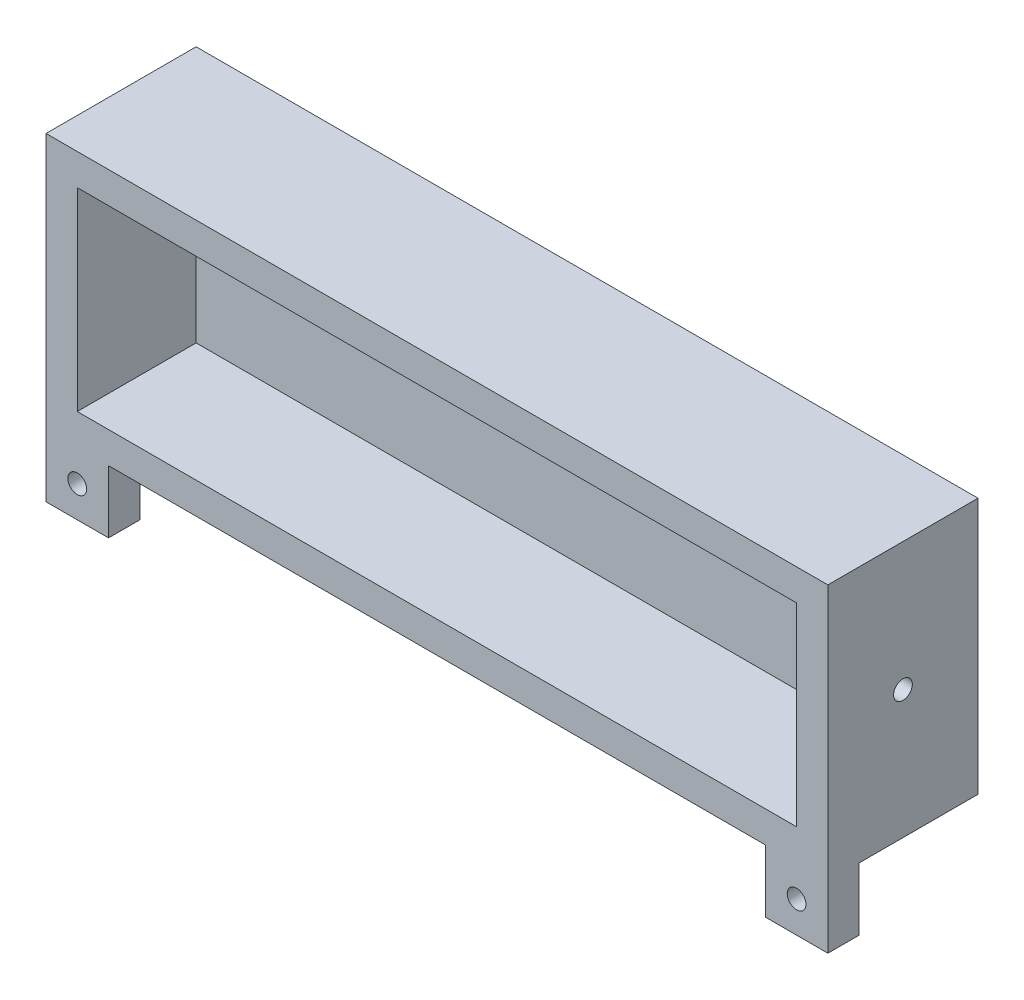
ISO-10303-21;
HEADER;
FILE_DESCRIPTION(('STEP AP214'),'2;1');
FILE_NAME('part.step','',(''),(''),'','','');
FILE_SCHEMA(('AUTOMOTIVE_DESIGN { 1 0 10303 214 1 1 1 1 }'));
ENDSEC;
DATA;
#1=APPLICATION_CONTEXT('core data for automotive mechanical design processes');
#2=APPLICATION_PROTOCOL_DEFINITION('international standard','automotive_design',2000,#1);
#3=PRODUCT_CONTEXT('',#1,'mechanical');
#4=PRODUCT('Part','Part','',(#3));
#5=PRODUCT_RELATED_PRODUCT_CATEGORY('part','',(#4));
#6=PRODUCT_DEFINITION_FORMATION('','',#4);
#7=PRODUCT_DEFINITION_CONTEXT('part definition',#1,'design');
#8=PRODUCT_DEFINITION('design','',#6,#7);
#9=PRODUCT_DEFINITION_SHAPE('','',#8);
#10=(LENGTH_UNIT() NAMED_UNIT(*) SI_UNIT(.MILLI.,.METRE.));
#11=(NAMED_UNIT(*) PLANE_ANGLE_UNIT() SI_UNIT($,.RADIAN.));
#12=(NAMED_UNIT(*) SI_UNIT($,.STERADIAN.) SOLID_ANGLE_UNIT());
#13=UNCERTAINTY_MEASURE_WITH_UNIT(LENGTH_MEASURE(1.E-05),#10,'distance_accuracy_value','');
#14=(GEOMETRIC_REPRESENTATION_CONTEXT(3) GLOBAL_UNCERTAINTY_ASSIGNED_CONTEXT((#13)) GLOBAL_UNIT_ASSIGNED_CONTEXT((#10,
#11,#12)) REPRESENTATION_CONTEXT('',''));
#15=CARTESIAN_POINT('',(0.,0.,0.));
#16=DIRECTION('',(0.,0.,1.));
#17=DIRECTION('',(1.,0.,0.));
#18=AXIS2_PLACEMENT_3D('',#15,#16,#17);
#19=CARTESIAN_POINT('',(0.,-5.,19.));
#20=DIRECTION('',(0.,1.,0.));
#21=DIRECTION('',(0.,0.,1.));
#22=AXIS2_PLACEMENT_3D('',#19,#20,#21);
#23=PLANE('',#22);
#24=DIRECTION('',(0.,0.,-1.));
#25=VECTOR('',#24,1.);
#26=CARTESIAN_POINT('',(110.,-5.,19.));
#27=LINE('',#26,#25);
#28=CARTESIAN_POINT('',(110.,-5.,19.));
#29=VERTEX_POINT('',#28);
#30=CARTESIAN_POINT('',(110.,-5.,14.));
#31=VERTEX_POINT('',#30);
#32=EDGE_CURVE('E160',#29,#31,#27,.T.);
#33=ORIENTED_EDGE('',*,*,#32,.F.);
#34=DIRECTION('',(1.,0.,0.));
#35=VECTOR('',#34,1.);
#36=CARTESIAN_POINT('',(0.,-5.,19.));
#37=LINE('',#36,#35);
#38=CARTESIAN_POINT('',(5.,-5.,19.));
#39=VERTEX_POINT('',#38);
#40=EDGE_CURVE('E143',#39,#29,#37,.T.);
#41=ORIENTED_EDGE('',*,*,#40,.F.);
#42=DIRECTION('',(0.,0.,1.));
#43=VECTOR('',#42,1.);
#44=CARTESIAN_POINT('',(5.,-5.,19.));
#45=LINE('',#44,#43);
#46=CARTESIAN_POINT('',(5.,-5.,14.));
#47=VERTEX_POINT('',#46);
#48=EDGE_CURVE('E179',#47,#39,#45,.T.);
#49=ORIENTED_EDGE('',*,*,#48,.F.);
#50=DIRECTION('',(1.,0.,0.));
#51=VECTOR('',#50,1.);
#52=CARTESIAN_POINT('',(-5.,-5.,14.));
#53=LINE('',#52,#51);
#54=CARTESIAN_POINT('',(-5.,-5.,14.));
#55=VERTEX_POINT('',#54);
#56=EDGE_CURVE('E56',#55,#47,#53,.T.);
#57=ORIENTED_EDGE('',*,*,#56,.F.);
#58=DIRECTION('',(0.,0.,-1.));
#59=VECTOR('',#58,1.);
#60=CARTESIAN_POINT('',(-5.,-5.,19.));
#61=LINE('',#60,#59);
#62=CARTESIAN_POINT('',(-5.,-5.,-5.));
#63=VERTEX_POINT('',#62);
#64=EDGE_CURVE('E11',#55,#63,#61,.T.);
#65=ORIENTED_EDGE('',*,*,#64,.T.);
#66=DIRECTION('',(1.,0.,0.));
#67=VECTOR('',#66,1.);
#68=CARTESIAN_POINT('',(0.,-5.,-5.));
#69=LINE('',#68,#67);
#70=CARTESIAN_POINT('',(120.,-5.,-5.));
#71=VERTEX_POINT('',#70);
#72=EDGE_CURVE('E233',#63,#71,#69,.T.);
#73=ORIENTED_EDGE('',*,*,#72,.T.);
#74=DIRECTION('',(0.,0.,-1.));
#75=VECTOR('',#74,1.);
#76=CARTESIAN_POINT('',(120.,-5.,19.));
#77=LINE('',#76,#75);
#78=CARTESIAN_POINT('',(120.,-5.,14.));
#79=VERTEX_POINT('',#78);
#80=EDGE_CURVE('E41',#79,#71,#77,.T.);
#81=ORIENTED_EDGE('',*,*,#80,.F.);
#82=DIRECTION('',(1.,0.,0.));
#83=VECTOR('',#82,1.);
#84=CARTESIAN_POINT('',(120.,-5.,14.));
#85=LINE('',#84,#83);
#86=EDGE_CURVE('E158',#31,#79,#85,.T.);
#87=ORIENTED_EDGE('',*,*,#86,.F.);
#88=EDGE_LOOP('',(#33,#41,#49,#57,#65,#73,#81,#87));
#89=FACE_BOUND('',#88,.T.);
#90=ADVANCED_FACE('F32',(#89),#23,.F.);
#91=CARTESIAN_POINT('',(0.,0.,19.));
#92=DIRECTION('',(0.,0.,-1.));
#93=DIRECTION('',(-1.,0.,0.));
#94=AXIS2_PLACEMENT_3D('',#91,#92,#93);
#95=PLANE('',#94);
#96=CARTESIAN_POINT('',(0.,-10.,19.));
#97=DIRECTION('',(0.,0.,-1.));
#98=DIRECTION('',(-1.,0.,0.));
#99=AXIS2_PLACEMENT_3D('',#96,#97,#98);
#100=CIRCLE('',#99,1.5);
#101=CARTESIAN_POINT('',(-1.5,-10.,19.));
#102=VERTEX_POINT('',#101);
#103=EDGE_CURVE('E168',#102,#102,#100,.T.);
#104=ORIENTED_EDGE('',*,*,#103,.T.);
#105=EDGE_LOOP('',(#104));
#106=FACE_BOUND('',#105,.T.);
#107=CARTESIAN_POINT('',(115.,-10.,19.));
#108=DIRECTION('',(0.,0.,-1.));
#109=DIRECTION('',(-1.,0.,0.));
#110=AXIS2_PLACEMENT_3D('',#107,#108,#109);
#111=CIRCLE('',#110,1.5);
#112=CARTESIAN_POINT('',(113.5,-10.,19.));
#113=VERTEX_POINT('',#112);
#114=EDGE_CURVE('E340',#113,#113,#111,.T.);
#115=ORIENTED_EDGE('',*,*,#114,.T.);
#116=EDGE_LOOP('',(#115));
#117=FACE_BOUND('',#116,.T.);
#118=DIRECTION('',(0.,-1.,0.));
#119=VECTOR('',#118,1.);
#120=CARTESIAN_POINT('',(-5.,0.,19.));
#121=LINE('',#120,#119);
#122=CARTESIAN_POINT('',(-5.,36.,19.));
#123=VERTEX_POINT('',#122);
#124=CARTESIAN_POINT('',(-5.,-15.,19.));
#125=VERTEX_POINT('',#124);
#126=EDGE_CURVE('E246',#123,#125,#121,.T.);
#127=ORIENTED_EDGE('',*,*,#126,.T.);
#128=DIRECTION('',(-1.,0.,0.));
#129=VECTOR('',#128,1.);
#130=CARTESIAN_POINT('',(-5.,-15.,19.));
#131=LINE('',#130,#129);
#132=CARTESIAN_POINT('',(5.,-15.,19.));
#133=VERTEX_POINT('',#132);
#134=EDGE_CURVE('E183',#133,#125,#131,.T.);
#135=ORIENTED_EDGE('',*,*,#134,.F.);
#136=DIRECTION('',(0.,1.,0.));
#137=VECTOR('',#136,1.);
#138=CARTESIAN_POINT('',(5.,-15.,19.));
#139=LINE('',#138,#137);
#140=EDGE_CURVE('E186',#133,#39,#139,.T.);
#141=ORIENTED_EDGE('',*,*,#140,.T.);
#142=ORIENTED_EDGE('',*,*,#40,.T.);
#143=DIRECTION('',(0.,1.,0.));
#144=VECTOR('',#143,1.);
#145=CARTESIAN_POINT('',(110.,-15.,19.));
#146=LINE('',#145,#144);
#147=CARTESIAN_POINT('',(110.,-15.,19.));
#148=VERTEX_POINT('',#147);
#149=EDGE_CURVE('E150',#148,#29,#146,.T.);
#150=ORIENTED_EDGE('',*,*,#149,.F.);
#151=DIRECTION('',(-1.,0.,0.));
#152=VECTOR('',#151,1.);
#153=CARTESIAN_POINT('',(120.,-15.,19.));
#154=LINE('',#153,#152);
#155=CARTESIAN_POINT('',(120.,-15.,19.));
#156=VERTEX_POINT('',#155);
#157=EDGE_CURVE('E146',#156,#148,#154,.T.);
#158=ORIENTED_EDGE('',*,*,#157,.F.);
#159=DIRECTION('',(0.,1.,0.));
#160=VECTOR('',#159,1.);
#161=CARTESIAN_POINT('',(120.,0.,19.));
#162=LINE('',#161,#160);
#163=CARTESIAN_POINT('',(120.,36.,19.));
#164=VERTEX_POINT('',#163);
#165=EDGE_CURVE('E133',#156,#164,#162,.T.);
#166=ORIENTED_EDGE('',*,*,#165,.T.);
#167=DIRECTION('',(-1.,0.,0.));
#168=VECTOR('',#167,1.);
#169=CARTESIAN_POINT('',(0.,36.,19.));
#170=LINE('',#169,#168);
#171=EDGE_CURVE('E142',#164,#123,#170,.T.);
#172=ORIENTED_EDGE('',*,*,#171,.T.);
#173=EDGE_LOOP('',(#127,#135,#141,#142,#150,#158,#166,#172));
#174=FACE_BOUND('',#173,.T.);
#175=DIRECTION('',(0.,-1.,0.));
#176=VECTOR('',#175,1.);
#177=CARTESIAN_POINT('',(0.,0.,19.));
#178=LINE('',#177,#176);
#179=CARTESIAN_POINT('',(0.,31.,19.));
#180=VERTEX_POINT('',#179);
#181=CARTESIAN_POINT('',(0.,0.,19.));
#182=VERTEX_POINT('',#181);
#183=EDGE_CURVE('E201',#180,#182,#178,.T.);
#184=ORIENTED_EDGE('',*,*,#183,.F.);
#185=DIRECTION('',(-1.,0.,0.));
#186=VECTOR('',#185,1.);
#187=CARTESIAN_POINT('',(0.,31.,19.));
#188=LINE('',#187,#186);
#189=CARTESIAN_POINT('',(115.,31.,19.));
#190=VERTEX_POINT('',#189);
#191=EDGE_CURVE('E209',#190,#180,#188,.T.);
#192=ORIENTED_EDGE('',*,*,#191,.F.);
#193=DIRECTION('',(0.,1.,0.));
#194=VECTOR('',#193,1.);
#195=CARTESIAN_POINT('',(115.,0.,19.));
#196=LINE('',#195,#194);
#197=CARTESIAN_POINT('',(115.,0.,19.));
#198=VERTEX_POINT('',#197);
#199=EDGE_CURVE('E206',#198,#190,#196,.T.);
#200=ORIENTED_EDGE('',*,*,#199,.F.);
#201=DIRECTION('',(1.,0.,0.));
#202=VECTOR('',#201,1.);
#203=CARTESIAN_POINT('',(0.,0.,19.));
#204=LINE('',#203,#202);
#205=EDGE_CURVE('E203',#182,#198,#204,.T.);
#206=ORIENTED_EDGE('',*,*,#205,.F.);
#207=EDGE_LOOP('',(#184,#192,#200,#206));
#208=FACE_BOUND('',#207,.T.);
#209=ADVANCED_FACE('F147',(#106,#117,#174,#208),#95,.F.);
#210=CARTESIAN_POINT('',(-5.,0.,19.));
#211=DIRECTION('',(1.,0.,0.));
#212=DIRECTION('',(0.,0.,-1.));
#213=AXIS2_PLACEMENT_3D('',#210,#211,#212);
#214=PLANE('',#213);
#215=DIRECTION('',(0.,-1.,0.));
#216=VECTOR('',#215,1.);
#217=CARTESIAN_POINT('',(-5.,0.,-5.));
#218=LINE('',#217,#216);
#219=CARTESIAN_POINT('',(-5.,36.,-5.));
#220=VERTEX_POINT('',#219);
#221=EDGE_CURVE('E231',#220,#63,#218,.T.);
#222=ORIENTED_EDGE('',*,*,#221,.T.);
#223=ORIENTED_EDGE('',*,*,#64,.F.);
#224=DIRECTION('',(0.,1.,0.));
#225=VECTOR('',#224,1.);
#226=CARTESIAN_POINT('',(-5.,-15.,14.));
#227=LINE('',#226,#225);
#228=CARTESIAN_POINT('',(-5.,-15.,14.));
#229=VERTEX_POINT('',#228);
#230=EDGE_CURVE('E195',#229,#55,#227,.T.);
#231=ORIENTED_EDGE('',*,*,#230,.F.);
#232=DIRECTION('',(0.,0.,-1.));
#233=VECTOR('',#232,1.);
#234=CARTESIAN_POINT('',(-5.,-15.,19.));
#235=LINE('',#234,#233);
#236=EDGE_CURVE('E175',#125,#229,#235,.T.);
#237=ORIENTED_EDGE('',*,*,#236,.F.);
#238=ORIENTED_EDGE('',*,*,#126,.F.);
#239=DIRECTION('',(0.,0.,-1.));
#240=VECTOR('',#239,1.);
#241=CARTESIAN_POINT('',(-5.,36.,19.));
#242=LINE('',#241,#240);
#243=EDGE_CURVE('E235',#123,#220,#242,.T.);
#244=ORIENTED_EDGE('',*,*,#243,.T.);
#245=EDGE_LOOP('',(#222,#223,#231,#237,#238,#244));
#246=FACE_BOUND('',#245,.T.);
#247=ADVANCED_FACE('F257',(#246),#214,.F.);
#248=CARTESIAN_POINT('',(120.,0.,19.));
#249=DIRECTION('',(-1.,0.,0.));
#250=DIRECTION('',(0.,0.,1.));
#251=AXIS2_PLACEMENT_3D('',#248,#249,#250);
#252=PLANE('',#251);
#253=CARTESIAN_POINT('',(120.,15.5,7.));
#254=DIRECTION('',(1.,0.,0.));
#255=DIRECTION('',(0.,0.,-1.));
#256=AXIS2_PLACEMENT_3D('',#253,#254,#255);
#257=CIRCLE('',#256,1.5);
#258=CARTESIAN_POINT('',(120.,15.5,5.5));
#259=VERTEX_POINT('',#258);
#260=EDGE_CURVE('E198',#259,#259,#257,.T.);
#261=ORIENTED_EDGE('',*,*,#260,.F.);
#262=EDGE_LOOP('',(#261));
#263=FACE_BOUND('',#262,.T.);
#264=DIRECTION('',(0.,1.,0.));
#265=VECTOR('',#264,1.);
#266=CARTESIAN_POINT('',(120.,0.,-5.));
#267=LINE('',#266,#265);
#268=CARTESIAN_POINT('',(120.,36.,-5.));
#269=VERTEX_POINT('',#268);
#270=EDGE_CURVE('E240',#71,#269,#267,.T.);
#271=ORIENTED_EDGE('',*,*,#270,.T.);
#272=DIRECTION('',(0.,0.,-1.));
#273=VECTOR('',#272,1.);
#274=CARTESIAN_POINT('',(120.,36.,19.));
#275=LINE('',#274,#273);
#276=EDGE_CURVE('E139',#164,#269,#275,.T.);
#277=ORIENTED_EDGE('',*,*,#276,.F.);
#278=ORIENTED_EDGE('',*,*,#165,.F.);
#279=DIRECTION('',(0.,0.,1.));
#280=VECTOR('',#279,1.);
#281=CARTESIAN_POINT('',(120.,-15.,19.));
#282=LINE('',#281,#280);
#283=CARTESIAN_POINT('',(120.,-15.,14.));
#284=VERTEX_POINT('',#283);
#285=EDGE_CURVE('E137',#284,#156,#282,.T.);
#286=ORIENTED_EDGE('',*,*,#285,.F.);
#287=DIRECTION('',(0.,1.,0.));
#288=VECTOR('',#287,1.);
#289=CARTESIAN_POINT('',(120.,-15.,14.));
#290=LINE('',#289,#288);
#291=EDGE_CURVE('E49',#284,#79,#290,.T.);
#292=ORIENTED_EDGE('',*,*,#291,.T.);
#293=ORIENTED_EDGE('',*,*,#80,.T.);
#294=EDGE_LOOP('',(#271,#277,#278,#286,#292,#293));
#295=FACE_BOUND('',#294,.T.);
#296=ADVANCED_FACE('F135',(#263,#295),#252,.F.);
#297=CARTESIAN_POINT('',(0.,36.,19.));
#298=DIRECTION('',(0.,-1.,0.));
#299=DIRECTION('',(0.,0.,-1.));
#300=AXIS2_PLACEMENT_3D('',#297,#298,#299);
#301=PLANE('',#300);
#302=DIRECTION('',(-1.,0.,0.));
#303=VECTOR('',#302,1.);
#304=CARTESIAN_POINT('',(0.,36.,-5.));
#305=LINE('',#304,#303);
#306=EDGE_CURVE('E243',#269,#220,#305,.T.);
#307=ORIENTED_EDGE('',*,*,#306,.T.);
#308=ORIENTED_EDGE('',*,*,#243,.F.);
#309=ORIENTED_EDGE('',*,*,#171,.F.);
#310=ORIENTED_EDGE('',*,*,#276,.T.);
#311=EDGE_LOOP('',(#307,#308,#309,#310));
#312=FACE_BOUND('',#311,.T.);
#313=ADVANCED_FACE('F252',(#312),#301,.F.);
#314=CARTESIAN_POINT('',(0.,0.,-5.));
#315=DIRECTION('',(0.,0.,-1.));
#316=DIRECTION('',(-1.,0.,0.));
#317=AXIS2_PLACEMENT_3D('',#314,#315,#316);
#318=PLANE('',#317);
#319=ORIENTED_EDGE('',*,*,#221,.F.);
#320=ORIENTED_EDGE('',*,*,#306,.F.);
#321=ORIENTED_EDGE('',*,*,#270,.F.);
#322=ORIENTED_EDGE('',*,*,#72,.F.);
#323=EDGE_LOOP('',(#319,#320,#321,#322));
#324=FACE_BOUND('',#323,.T.);
#325=ADVANCED_FACE('F34',(#324),#318,.T.);
#326=CARTESIAN_POINT('',(0.,0.,19.));
#327=DIRECTION('',(1.,0.,0.));
#328=DIRECTION('',(0.,0.,-1.));
#329=AXIS2_PLACEMENT_3D('',#326,#327,#328);
#330=PLANE('',#329);
#331=DIRECTION('',(0.,-1.,0.));
#332=VECTOR('',#331,1.);
#333=CARTESIAN_POINT('',(0.,0.,0.));
#334=LINE('',#333,#332);
#335=CARTESIAN_POINT('',(0.,31.,0.));
#336=VERTEX_POINT('',#335);
#337=CARTESIAN_POINT('',(0.,0.,0.));
#338=VERTEX_POINT('',#337);
#339=EDGE_CURVE('E212',#336,#338,#334,.T.);
#340=ORIENTED_EDGE('',*,*,#339,.F.);
#341=DIRECTION('',(0.,0.,-1.));
#342=VECTOR('',#341,1.);
#343=CARTESIAN_POINT('',(0.,31.,19.));
#344=LINE('',#343,#342);
#345=EDGE_CURVE('E211',#180,#336,#344,.T.);
#346=ORIENTED_EDGE('',*,*,#345,.F.);
#347=ORIENTED_EDGE('',*,*,#183,.T.);
#348=DIRECTION('',(0.,0.,-1.));
#349=VECTOR('',#348,1.);
#350=CARTESIAN_POINT('',(0.,0.,19.));
#351=LINE('',#350,#349);
#352=EDGE_CURVE('E228',#182,#338,#351,.T.);
#353=ORIENTED_EDGE('',*,*,#352,.T.);
#354=EDGE_LOOP('',(#340,#346,#347,#353));
#355=FACE_BOUND('',#354,.T.);
#356=ADVANCED_FACE('F297',(#355),#330,.T.);
#357=CARTESIAN_POINT('',(0.,0.,19.));
#358=DIRECTION('',(0.,1.,0.));
#359=DIRECTION('',(0.,0.,1.));
#360=AXIS2_PLACEMENT_3D('',#357,#358,#359);
#361=PLANE('',#360);
#362=DIRECTION('',(1.,0.,0.));
#363=VECTOR('',#362,1.);
#364=CARTESIAN_POINT('',(0.,0.,0.));
#365=LINE('',#364,#363);
#366=CARTESIAN_POINT('',(115.,0.,0.));
#367=VERTEX_POINT('',#366);
#368=EDGE_CURVE('E215',#338,#367,#365,.T.);
#369=ORIENTED_EDGE('',*,*,#368,.F.);
#370=ORIENTED_EDGE('',*,*,#352,.F.);
#371=ORIENTED_EDGE('',*,*,#205,.T.);
#372=DIRECTION('',(0.,0.,-1.));
#373=VECTOR('',#372,1.);
#374=CARTESIAN_POINT('',(115.,0.,19.));
#375=LINE('',#374,#373);
#376=EDGE_CURVE('E225',#198,#367,#375,.T.);
#377=ORIENTED_EDGE('',*,*,#376,.T.);
#378=EDGE_LOOP('',(#369,#370,#371,#377));
#379=FACE_BOUND('',#378,.T.);
#380=ADVANCED_FACE('F302',(#379),#361,.T.);
#381=CARTESIAN_POINT('',(115.,0.,19.));
#382=DIRECTION('',(-1.,0.,0.));
#383=DIRECTION('',(0.,0.,1.));
#384=AXIS2_PLACEMENT_3D('',#381,#382,#383);
#385=PLANE('',#384);
#386=CARTESIAN_POINT('',(115.,15.5,7.));
#387=DIRECTION('',(-1.,0.,0.));
#388=DIRECTION('',(0.,0.,1.));
#389=AXIS2_PLACEMENT_3D('',#386,#387,#388);
#390=CIRCLE('',#389,1.5);
#391=CARTESIAN_POINT('',(115.,15.5,8.5));
#392=VERTEX_POINT('',#391);
#393=EDGE_CURVE('E36',#392,#392,#390,.T.);
#394=ORIENTED_EDGE('',*,*,#393,.F.);
#395=EDGE_LOOP('',(#394));
#396=FACE_BOUND('',#395,.T.);
#397=DIRECTION('',(0.,1.,0.));
#398=VECTOR('',#397,1.);
#399=CARTESIAN_POINT('',(115.,0.,0.));
#400=LINE('',#399,#398);
#401=CARTESIAN_POINT('',(115.,31.,0.));
#402=VERTEX_POINT('',#401);
#403=EDGE_CURVE('E217',#367,#402,#400,.T.);
#404=ORIENTED_EDGE('',*,*,#403,.F.);
#405=ORIENTED_EDGE('',*,*,#376,.F.);
#406=ORIENTED_EDGE('',*,*,#199,.T.);
#407=DIRECTION('',(0.,0.,-1.));
#408=VECTOR('',#407,1.);
#409=CARTESIAN_POINT('',(115.,31.,19.));
#410=LINE('',#409,#408);
#411=EDGE_CURVE('E222',#190,#402,#410,.T.);
#412=ORIENTED_EDGE('',*,*,#411,.T.);
#413=EDGE_LOOP('',(#404,#405,#406,#412));
#414=FACE_BOUND('',#413,.T.);
#415=ADVANCED_FACE('F428',(#396,#414),#385,.T.);
#416=CARTESIAN_POINT('',(0.,31.,19.));
#417=DIRECTION('',(0.,-1.,0.));
#418=DIRECTION('',(0.,0.,-1.));
#419=AXIS2_PLACEMENT_3D('',#416,#417,#418);
#420=PLANE('',#419);
#421=DIRECTION('',(-1.,0.,0.));
#422=VECTOR('',#421,1.);
#423=CARTESIAN_POINT('',(0.,31.,0.));
#424=LINE('',#423,#422);
#425=EDGE_CURVE('E204',#402,#336,#424,.T.);
#426=ORIENTED_EDGE('',*,*,#425,.F.);
#427=ORIENTED_EDGE('',*,*,#411,.F.);
#428=ORIENTED_EDGE('',*,*,#191,.T.);
#429=ORIENTED_EDGE('',*,*,#345,.T.);
#430=EDGE_LOOP('',(#426,#427,#428,#429));
#431=FACE_BOUND('',#430,.T.);
#432=ADVANCED_FACE('F418',(#431),#420,.T.);
#433=CARTESIAN_POINT('',(0.,0.,0.));
#434=DIRECTION('',(0.,0.,-1.));
#435=DIRECTION('',(-1.,0.,0.));
#436=AXIS2_PLACEMENT_3D('',#433,#434,#435);
#437=PLANE('',#436);
#438=ORIENTED_EDGE('',*,*,#339,.T.);
#439=ORIENTED_EDGE('',*,*,#368,.T.);
#440=ORIENTED_EDGE('',*,*,#403,.T.);
#441=ORIENTED_EDGE('',*,*,#425,.T.);
#442=EDGE_LOOP('',(#438,#439,#440,#441));
#443=FACE_BOUND('',#442,.T.);
#444=ADVANCED_FACE('F278',(#443),#437,.F.);
#445=CARTESIAN_POINT('',(101.,15.5,7.));
#446=DIRECTION('',(1.,0.,0.));
#447=DIRECTION('',(0.,0.,-1.));
#448=AXIS2_PLACEMENT_3D('',#445,#446,#447);
#449=CYLINDRICAL_SURFACE('',#448,1.5);
#450=ORIENTED_EDGE('',*,*,#393,.T.);
#451=EDGE_LOOP('',(#450));
#452=FACE_BOUND('',#451,.T.);
#453=ORIENTED_EDGE('',*,*,#260,.T.);
#454=EDGE_LOOP('',(#453));
#455=FACE_BOUND('',#454,.T.);
#456=ADVANCED_FACE('F270',(#452,#455),#449,.F.);
#457=CARTESIAN_POINT('',(-5.,-15.,14.));
#458=DIRECTION('',(0.,0.,1.));
#459=DIRECTION('',(1.,0.,0.));
#460=AXIS2_PLACEMENT_3D('',#457,#458,#459);
#461=PLANE('',#460);
#462=CARTESIAN_POINT('',(0.,-10.,14.));
#463=DIRECTION('',(0.,0.,-1.));
#464=DIRECTION('',(-1.,0.,0.));
#465=AXIS2_PLACEMENT_3D('',#462,#463,#464);
#466=CIRCLE('',#465,1.5);
#467=CARTESIAN_POINT('',(-1.5,-10.,14.));
#468=VERTEX_POINT('',#467);
#469=EDGE_CURVE('E339',#468,#468,#466,.T.);
#470=ORIENTED_EDGE('',*,*,#469,.F.);
#471=EDGE_LOOP('',(#470));
#472=FACE_BOUND('',#471,.T.);
#473=ORIENTED_EDGE('',*,*,#56,.T.);
#474=DIRECTION('',(0.,1.,0.));
#475=VECTOR('',#474,1.);
#476=CARTESIAN_POINT('',(5.,-15.,14.));
#477=LINE('',#476,#475);
#478=CARTESIAN_POINT('',(5.,-15.,14.));
#479=VERTEX_POINT('',#478);
#480=EDGE_CURVE('E192',#479,#47,#477,.T.);
#481=ORIENTED_EDGE('',*,*,#480,.F.);
#482=DIRECTION('',(1.,0.,0.));
#483=VECTOR('',#482,1.);
#484=CARTESIAN_POINT('',(-5.,-15.,14.));
#485=LINE('',#484,#483);
#486=EDGE_CURVE('E178',#229,#479,#485,.T.);
#487=ORIENTED_EDGE('',*,*,#486,.F.);
#488=ORIENTED_EDGE('',*,*,#230,.T.);
#489=EDGE_LOOP('',(#473,#481,#487,#488));
#490=FACE_BOUND('',#489,.T.);
#491=ADVANCED_FACE('F268',(#472,#490),#461,.F.);
#492=CARTESIAN_POINT('',(5.,-15.,19.));
#493=DIRECTION('',(-1.,0.,0.));
#494=DIRECTION('',(0.,0.,1.));
#495=AXIS2_PLACEMENT_3D('',#492,#493,#494);
#496=PLANE('',#495);
#497=ORIENTED_EDGE('',*,*,#48,.T.);
#498=ORIENTED_EDGE('',*,*,#140,.F.);
#499=DIRECTION('',(0.,0.,1.));
#500=VECTOR('',#499,1.);
#501=CARTESIAN_POINT('',(5.,-15.,19.));
#502=LINE('',#501,#500);
#503=EDGE_CURVE('E181',#479,#133,#502,.T.);
#504=ORIENTED_EDGE('',*,*,#503,.F.);
#505=ORIENTED_EDGE('',*,*,#480,.T.);
#506=EDGE_LOOP('',(#497,#498,#504,#505));
#507=FACE_BOUND('',#506,.T.);
#508=ADVANCED_FACE('F265',(#507),#496,.F.);
#509=CARTESIAN_POINT('',(0.,-15.,0.));
#510=DIRECTION('',(0.,-1.,0.));
#511=DIRECTION('',(0.,0.,-1.));
#512=AXIS2_PLACEMENT_3D('',#509,#510,#511);
#513=PLANE('',#512);
#514=ORIENTED_EDGE('',*,*,#236,.T.);
#515=ORIENTED_EDGE('',*,*,#486,.T.);
#516=ORIENTED_EDGE('',*,*,#503,.T.);
#517=ORIENTED_EDGE('',*,*,#134,.T.);
#518=EDGE_LOOP('',(#514,#515,#516,#517));
#519=FACE_BOUND('',#518,.T.);
#520=ADVANCED_FACE('F260',(#519),#513,.T.);
#521=CARTESIAN_POINT('',(110.,-15.,19.));
#522=DIRECTION('',(1.,0.,0.));
#523=DIRECTION('',(0.,0.,-1.));
#524=AXIS2_PLACEMENT_3D('',#521,#522,#523);
#525=PLANE('',#524);
#526=ORIENTED_EDGE('',*,*,#32,.T.);
#527=DIRECTION('',(0.,1.,0.));
#528=VECTOR('',#527,1.);
#529=CARTESIAN_POINT('',(110.,-15.,14.));
#530=LINE('',#529,#528);
#531=CARTESIAN_POINT('',(110.,-15.,14.));
#532=VERTEX_POINT('',#531);
#533=EDGE_CURVE('E171',#532,#31,#530,.T.);
#534=ORIENTED_EDGE('',*,*,#533,.F.);
#535=DIRECTION('',(0.,0.,-1.));
#536=VECTOR('',#535,1.);
#537=CARTESIAN_POINT('',(110.,-15.,19.));
#538=LINE('',#537,#536);
#539=EDGE_CURVE('E153',#148,#532,#538,.T.);
#540=ORIENTED_EDGE('',*,*,#539,.F.);
#541=ORIENTED_EDGE('',*,*,#149,.T.);
#542=EDGE_LOOP('',(#526,#534,#540,#541));
#543=FACE_BOUND('',#542,.T.);
#544=ADVANCED_FACE('F313',(#543),#525,.F.);
#545=CARTESIAN_POINT('',(120.,-15.,14.));
#546=DIRECTION('',(0.,0.,1.));
#547=DIRECTION('',(1.,0.,0.));
#548=AXIS2_PLACEMENT_3D('',#545,#546,#547);
#549=PLANE('',#548);
#550=CARTESIAN_POINT('',(115.,-10.,14.));
#551=DIRECTION('',(0.,0.,-1.));
#552=DIRECTION('',(-1.,0.,0.));
#553=AXIS2_PLACEMENT_3D('',#550,#551,#552);
#554=CIRCLE('',#553,1.5);
#555=CARTESIAN_POINT('',(113.5,-10.,14.));
#556=VERTEX_POINT('',#555);
#557=EDGE_CURVE('E163',#556,#556,#554,.T.);
#558=ORIENTED_EDGE('',*,*,#557,.F.);
#559=EDGE_LOOP('',(#558));
#560=FACE_BOUND('',#559,.T.);
#561=ORIENTED_EDGE('',*,*,#86,.T.);
#562=ORIENTED_EDGE('',*,*,#291,.F.);
#563=DIRECTION('',(1.,0.,0.));
#564=VECTOR('',#563,1.);
#565=CARTESIAN_POINT('',(120.,-15.,14.));
#566=LINE('',#565,#564);
#567=EDGE_CURVE('E157',#532,#284,#566,.T.);
#568=ORIENTED_EDGE('',*,*,#567,.F.);
#569=ORIENTED_EDGE('',*,*,#533,.T.);
#570=EDGE_LOOP('',(#561,#562,#568,#569));
#571=FACE_BOUND('',#570,.T.);
#572=ADVANCED_FACE('F310',(#560,#571),#549,.F.);
#573=CARTESIAN_POINT('',(0.,-15.,0.));
#574=DIRECTION('',(0.,1.,0.));
#575=DIRECTION('',(0.,0.,1.));
#576=AXIS2_PLACEMENT_3D('',#573,#574,#575);
#577=PLANE('',#576);
#578=ORIENTED_EDGE('',*,*,#285,.T.);
#579=ORIENTED_EDGE('',*,*,#157,.T.);
#580=ORIENTED_EDGE('',*,*,#539,.T.);
#581=ORIENTED_EDGE('',*,*,#567,.T.);
#582=EDGE_LOOP('',(#578,#579,#580,#581));
#583=FACE_BOUND('',#582,.T.);
#584=ADVANCED_FACE('F155',(#583),#577,.F.);
#585=CARTESIAN_POINT('',(115.,-10.,19.));
#586=DIRECTION('',(0.,0.,-1.));
#587=DIRECTION('',(-1.,0.,0.));
#588=AXIS2_PLACEMENT_3D('',#585,#586,#587);
#589=CYLINDRICAL_SURFACE('',#588,1.5);
#590=ORIENTED_EDGE('',*,*,#114,.F.);
#591=EDGE_LOOP('',(#590));
#592=FACE_BOUND('',#591,.T.);
#593=ORIENTED_EDGE('',*,*,#557,.T.);
#594=EDGE_LOOP('',(#593));
#595=FACE_BOUND('',#594,.T.);
#596=ADVANCED_FACE('F326',(#592,#595),#589,.F.);
#597=CARTESIAN_POINT('',(0.,-10.,19.));
#598=DIRECTION('',(0.,0.,-1.));
#599=DIRECTION('',(-1.,0.,0.));
#600=AXIS2_PLACEMENT_3D('',#597,#598,#599);
#601=CYLINDRICAL_SURFACE('',#600,1.5);
#602=ORIENTED_EDGE('',*,*,#103,.F.);
#603=EDGE_LOOP('',(#602));
#604=FACE_BOUND('',#603,.T.);
#605=ORIENTED_EDGE('',*,*,#469,.T.);
#606=EDGE_LOOP('',(#605));
#607=FACE_BOUND('',#606,.T.);
#608=ADVANCED_FACE('F329',(#604,#607),#601,.F.);
#609=CLOSED_SHELL('',(#90,#209,#247,#296,#313,#325,#356,#380,#415,#432,#444,#456,#491,#508,#520,
#544,#572,#584,#596,#608));
#610=MANIFOLD_SOLID_BREP('B2',#609);
#611=ADVANCED_BREP_SHAPE_REPRESENTATION('',(#18,#610),#14);
#612=SHAPE_DEFINITION_REPRESENTATION(#9,#611);
ENDSEC;
END-ISO-10303-21;
